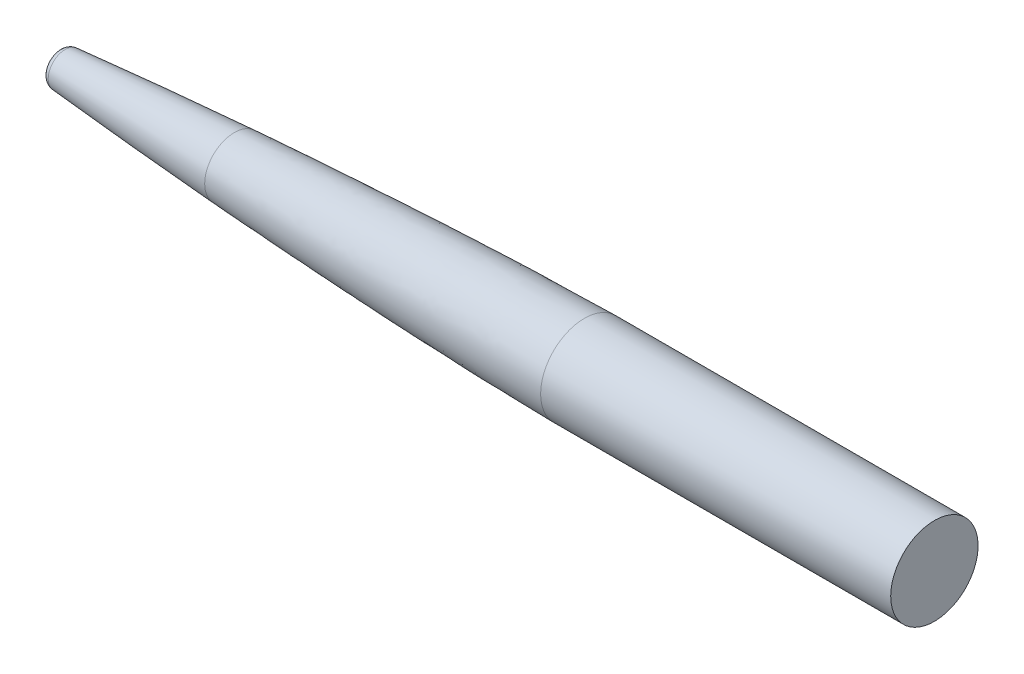
ISO-10303-21;
HEADER;
FILE_DESCRIPTION(('STEP AP214'),'2;1');
FILE_NAME('part.step','',(''),(''),'','','');
FILE_SCHEMA(('AUTOMOTIVE_DESIGN { 1 0 10303 214 1 1 1 1 }'));
ENDSEC;
DATA;
#1=APPLICATION_CONTEXT('core data for automotive mechanical design processes');
#2=APPLICATION_PROTOCOL_DEFINITION('international standard','automotive_design',2000,#1);
#3=PRODUCT_CONTEXT('',#1,'mechanical');
#4=PRODUCT('Part','Part','',(#3));
#5=PRODUCT_RELATED_PRODUCT_CATEGORY('part','',(#4));
#6=PRODUCT_DEFINITION_FORMATION('','',#4);
#7=PRODUCT_DEFINITION_CONTEXT('part definition',#1,'design');
#8=PRODUCT_DEFINITION('design','',#6,#7);
#9=PRODUCT_DEFINITION_SHAPE('','',#8);
#10=(LENGTH_UNIT() NAMED_UNIT(*) SI_UNIT(.MILLI.,.METRE.));
#11=(NAMED_UNIT(*) PLANE_ANGLE_UNIT() SI_UNIT($,.RADIAN.));
#12=(NAMED_UNIT(*) SI_UNIT($,.STERADIAN.) SOLID_ANGLE_UNIT());
#13=UNCERTAINTY_MEASURE_WITH_UNIT(LENGTH_MEASURE(1.E-05),#10,'distance_accuracy_value','');
#14=(GEOMETRIC_REPRESENTATION_CONTEXT(3) GLOBAL_UNCERTAINTY_ASSIGNED_CONTEXT((#13)) GLOBAL_UNIT_ASSIGNED_CONTEXT((#10,
#11,#12)) REPRESENTATION_CONTEXT('',''));
#15=CARTESIAN_POINT('',(0.,0.,0.));
#16=DIRECTION('',(0.,0.,1.));
#17=DIRECTION('',(1.,0.,0.));
#18=AXIS2_PLACEMENT_3D('',#15,#16,#17);
#19=CARTESIAN_POINT('',(177.8,0.,0.));
#20=DIRECTION('',(1.,0.,0.));
#21=DIRECTION('',(0.,0.,-1.));
#22=AXIS2_PLACEMENT_3D('',#19,#20,#21);
#23=PLANE('',#22);
#24=CARTESIAN_POINT('',(177.8,0.,0.));
#25=DIRECTION('',(1.,0.,0.));
#26=DIRECTION('',(0.,0.,-1.));
#27=AXIS2_PLACEMENT_3D('',#24,#25,#26);
#28=CIRCLE('',#27,7.6835);
#29=CARTESIAN_POINT('',(177.8,0.,-7.6835));
#30=VERTEX_POINT('',#29);
#31=EDGE_CURVE('E12',#30,#30,#28,.F.);
#32=ORIENTED_EDGE('',*,*,#31,.T.);
#33=EDGE_LOOP('',(#32));
#34=FACE_BOUND('',#33,.T.);
#35=CARTESIAN_POINT('',(177.8,0.,0.));
#36=DIRECTION('',(-1.,0.,0.));
#37=DIRECTION('',(0.,0.,1.));
#38=AXIS2_PLACEMENT_3D('',#35,#36,#37);
#39=CIRCLE('',#38,17.1561631561449);
#40=CARTESIAN_POINT('',(177.8,0.,17.1561631561449));
#41=VERTEX_POINT('',#40);
#42=EDGE_CURVE('E75',#41,#41,#39,.F.);
#43=ORIENTED_EDGE('',*,*,#42,.T.);
#44=EDGE_LOOP('',(#43));
#45=FACE_BOUND('',#44,.T.);
#46=ADVANCED_FACE('F53',(#34,#45),#23,.T.);
#47=CARTESIAN_POINT('',(381.,25.3619,0.));
#48=CARTESIAN_POINT('',(378.524593559037,25.3560980053445,0.));
#49=CARTESIAN_POINT('',(373.573934486035,25.3121128889867,0.));
#50=CARTESIAN_POINT('',(362.812607625121,25.1615270824821,0.));
#51=CARTESIAN_POINT('',(346.242443602137,24.8058332092385,0.));
#52=CARTESIAN_POINT('',(326.340171249397,24.2488561604149,0.));
#53=CARTESIAN_POINT('',(297.299602619171,23.2514406165286,0.));
#54=CARTESIAN_POINT('',(268.266826453605,22.0456358586878,0.));
#55=CARTESIAN_POINT('',(239.242169499469,20.6593607190887,0.));
#56=CARTESIAN_POINT('',(210.226471113295,19.0990664831563,0.));
#57=CARTESIAN_POINT('',(187.019770429096,17.7463170832523,0.));
#58=CARTESIAN_POINT('',(163.819588974037,16.285839146773,0.));
#59=CARTESIAN_POINT('',(140.626874096269,14.7110912909158,0.));
#60=CARTESIAN_POINT('',(117.442965680173,13.0111911873951,0.));
#61=CARTESIAN_POINT('',(94.2699405722977,11.1683965876158,0.));
#62=CARTESIAN_POINT('',(71.111079527847,9.1542171250851,0.));
#63=CARTESIAN_POINT('',(49.7481453938475,7.08897490579236,0.));
#64=CARTESIAN_POINT('',(31.8410851129706,5.12991227535654,0.));
#65=CARTESIAN_POINT('',(18.4911553593057,3.43769538635818,0.));
#66=CARTESIAN_POINT('',(10.2749378330354,2.22000164204755,0.));
#67=CARTESIAN_POINT('',(5.7055757200537,1.42868481896333,0.));
#68=CARTESIAN_POINT('',(3.28114901441044,0.942604320543406,0.));
#69=CARTESIAN_POINT('',(1.98341265106635,0.645281043026791,0.));
#70=CARTESIAN_POINT('',(1.26037027723223,0.458588114335736,0.));
#71=CARTESIAN_POINT('',(0.83282189617331,0.335886962993377,0.));
#72=CARTESIAN_POINT('',(0.570742032311502,0.252932932688025,0.));
#73=CARTESIAN_POINT('',(0.391244533489601,0.190542861533175,0.));
#74=CARTESIAN_POINT('',(0.271031854491536,0.144556968473102,0.));
#75=CARTESIAN_POINT('',(0.191250301377203,0.111419343372318,0.));
#76=CARTESIAN_POINT('',(0.124712658845111,0.0809738507329624,0.));
#77=CARTESIAN_POINT('',(0.077894833494557,0.0572325728760499,0.));
#78=CARTESIAN_POINT('',(0.0422729180777764,0.036450053215517,0.));
#79=CARTESIAN_POINT('',(0.0176817172437348,0.0192058780204196,0.));
#80=CARTESIAN_POINT('',(0.00638967288776374,0.00924561715961565,0.));
#81=CARTESIAN_POINT('',(0.00194370173082246,0.00324186171888322,0.));
#82=CARTESIAN_POINT('',(0.,0.,0.));
#83=B_SPLINE_CURVE_WITH_KNOTS('',4,(#47,#48,#49,#50,#51,#52,#53,#54,#55,#56,#57,#58,#59,#60,#61,
#62,#63,#64,#65,#66,#67,#68,#69,#70,#71,#72,#73,#74,#75,#76,#77,#78,#79,#80,#81,#82),
.UNSPECIFIED.,.F.,.F.,(5,1,1,1,1,1,1,1,1,1,1,1,1,1,1,1,1,1,1,1,1,1,1,1,1,1,1,1,1,1,1,1,5),(0.,
0.0259103187572514,0.0518206375145026,0.112650211825192,0.173479786222072,0.234309360683451,
0.355968509754322,0.416798084351541,0.47762765878568,0.538457233075586,0.599286807374725,
0.660116381670231,0.720945955951906,0.781775530233654,0.842605104692207,0.90343467923664,
0.945591870170838,0.970321497056124,0.983449830559251,0.990366810007663,0.994126820115043,
0.99620029420814,0.997383649493844,0.998182277212857,0.998782153188388,0.999077289957593,
0.999372426726798,0.999529320045099,0.999686213363399,0.9998431066817,0.99992155334085,
0.999960776670425,1.),.UNSPECIFIED.);
#84=CARTESIAN_POINT('',(0.,0.,0.));
#85=DIRECTION('',(-1.,0.,0.));
#86=AXIS1_PLACEMENT('',#84,#85);
#87=SURFACE_OF_REVOLUTION('',#83,#86);
#88=CARTESIAN_POINT('',(79.67419209287,0.,0.));
#89=DIRECTION('',(-1.,0.,0.));
#90=DIRECTION('',(0.,0.,1.));
#91=AXIS2_PLACEMENT_3D('',#88,#89,#90);
#92=CIRCLE('',#91,9.87959247335485);
#93=CARTESIAN_POINT('',(79.67419209287,0.,9.87959247335485));
#94=VERTEX_POINT('',#93);
#95=EDGE_CURVE('E64',#94,#94,#92,.F.);
#96=ORIENTED_EDGE('',*,*,#95,.T.);
#97=EDGE_LOOP('',(#96));
#98=FACE_BOUND('',#97,.T.);
#99=ORIENTED_EDGE('',*,*,#42,.F.);
#100=EDGE_LOOP('',(#99));
#101=FACE_BOUND('',#100,.T.);
#102=ADVANCED_FACE('F79',(#98,#101),#87,.T.);
#103=CARTESIAN_POINT('',(76.2,0.,0.));
#104=DIRECTION('',(1.,0.,0.));
#105=DIRECTION('',(0.,0.,-1.));
#106=AXIS2_PLACEMENT_3D('',#103,#104,#105);
#107=PLANE('',#106);
#108=CARTESIAN_POINT('',(76.2,0.,0.));
#109=DIRECTION('',(1.,0.,0.));
#110=DIRECTION('',(0.,0.,-1.));
#111=AXIS2_PLACEMENT_3D('',#108,#109,#110);
#112=CIRCLE('',#111,6.08442013872907);
#113=CARTESIAN_POINT('',(76.2,0.,-6.08442013872907));
#114=VERTEX_POINT('',#113);
#115=EDGE_CURVE('E68',#114,#114,#112,.F.);
#116=ORIENTED_EDGE('',*,*,#115,.T.);
#117=EDGE_LOOP('',(#116));
#118=FACE_BOUND('',#117,.T.);
#119=ADVANCED_FACE('F82',(#118),#107,.F.);
#120=CARTESIAN_POINT('',(80.01,0.,0.));
#121=DIRECTION('',(-1.,0.,0.));
#122=DIRECTION('',(0.,0.,1.));
#123=AXIS2_PLACEMENT_3D('',#120,#121,#122);
#124=TOROIDAL_SURFACE('',#123,6.08442013872907,3.81);
#125=ORIENTED_EDGE('',*,*,#115,.F.);
#126=EDGE_LOOP('',(#125));
#127=FACE_BOUND('',#126,.T.);
#128=ORIENTED_EDGE('',*,*,#95,.F.);
#129=EDGE_LOOP('',(#128));
#130=FACE_BOUND('',#129,.T.);
#131=ADVANCED_FACE('F87',(#127,#130),#124,.T.);
#132=CARTESIAN_POINT('',(163.83,0.,0.));
#133=DIRECTION('',(1.,0.,0.));
#134=DIRECTION('',(0.,0.,-1.));
#135=AXIS2_PLACEMENT_3D('',#132,#133,#134);
#136=CYLINDRICAL_SURFACE('',#135,6.4135);
#137=CARTESIAN_POINT('',(176.53,0.,0.));
#138=DIRECTION('',(1.,0.,0.));
#139=DIRECTION('',(0.,0.,-1.));
#140=AXIS2_PLACEMENT_3D('',#137,#138,#139);
#141=CIRCLE('',#140,6.4135);
#142=CARTESIAN_POINT('',(176.53,0.,-6.4135));
#143=VERTEX_POINT('',#142);
#144=EDGE_CURVE('E60',#143,#143,#141,.T.);
#145=ORIENTED_EDGE('',*,*,#144,.T.);
#146=EDGE_LOOP('',(#145));
#147=FACE_BOUND('',#146,.T.);
#148=CARTESIAN_POINT('',(163.83,0.,0.));
#149=DIRECTION('',(1.,0.,0.));
#150=DIRECTION('',(0.,0.,-1.));
#151=AXIS2_PLACEMENT_3D('',#148,#149,#150);
#152=CIRCLE('',#151,6.4135);
#153=CARTESIAN_POINT('',(163.83,0.,-6.4135));
#154=VERTEX_POINT('',#153);
#155=EDGE_CURVE('E105',#154,#154,#152,.T.);
#156=ORIENTED_EDGE('',*,*,#155,.F.);
#157=EDGE_LOOP('',(#156));
#158=FACE_BOUND('',#157,.T.);
#159=ADVANCED_FACE('F86',(#147,#158),#136,.F.);
#160=CARTESIAN_POINT('',(163.83,0.,0.));
#161=DIRECTION('',(1.,0.,0.));
#162=DIRECTION('',(0.,0.,-1.));
#163=AXIS2_PLACEMENT_3D('',#160,#161,#162);
#164=PLANE('',#163);
#165=ORIENTED_EDGE('',*,*,#155,.T.);
#166=EDGE_LOOP('',(#165));
#167=FACE_BOUND('',#166,.T.);
#168=ADVANCED_FACE('F96',(#167),#164,.T.);
#169=CARTESIAN_POINT('',(176.53,0.,0.));
#170=DIRECTION('',(1.,0.,0.));
#171=DIRECTION('',(0.,0.,-1.));
#172=AXIS2_PLACEMENT_3D('',#169,#170,#171);
#173=TOROIDAL_SURFACE('',#172,7.6835,1.27);
#174=ORIENTED_EDGE('',*,*,#31,.F.);
#175=EDGE_LOOP('',(#174));
#176=FACE_BOUND('',#175,.T.);
#177=ORIENTED_EDGE('',*,*,#144,.F.);
#178=EDGE_LOOP('',(#177));
#179=FACE_BOUND('',#178,.T.);
#180=ADVANCED_FACE('F55',(#176,#179),#173,.T.);
#181=CLOSED_SHELL('',(#46,#102,#119,#131,#159,#168,#180));
#182=MANIFOLD_SOLID_BREP('B2_NOT_SHOWN',#181);
#183=CARTESIAN_POINT('',(381.,0.,0.));
#184=DIRECTION('',(1.,0.,0.));
#185=DIRECTION('',(0.,0.,-1.));
#186=AXIS2_PLACEMENT_3D('',#183,#184,#185);
#187=PLANE('',#186);
#188=CARTESIAN_POINT('',(381.,0.,0.));
#189=DIRECTION('',(-1.,0.,0.));
#190=DIRECTION('',(0.,0.,1.));
#191=AXIS2_PLACEMENT_3D('',#188,#189,#190);
#192=CIRCLE('',#191,6.35);
#193=CARTESIAN_POINT('',(381.,0.,6.35));
#194=VERTEX_POINT('',#193);
#195=EDGE_CURVE('E52',#194,#194,#192,.T.);
#196=ORIENTED_EDGE('',*,*,#195,.F.);
#197=EDGE_LOOP('',(#196));
#198=FACE_BOUND('',#197,.T.);
#199=CARTESIAN_POINT('',(381.,0.,0.));
#200=DIRECTION('',(-1.,0.,0.));
#201=DIRECTION('',(0.,0.,1.));
#202=AXIS2_PLACEMENT_3D('',#199,#200,#201);
#203=CIRCLE('',#202,25.3619);
#204=CARTESIAN_POINT('',(381.,0.,25.3619));
#205=VERTEX_POINT('',#204);
#206=EDGE_CURVE('E167',#205,#205,#203,.T.);
#207=ORIENTED_EDGE('',*,*,#206,.T.);
#208=EDGE_LOOP('',(#207));
#209=FACE_BOUND('',#208,.T.);
#210=ADVANCED_FACE('F164',(#198,#209),#187,.F.);
#211=CARTESIAN_POINT('',(584.2,0.,0.));
#212=DIRECTION('',(-1.,0.,0.));
#213=DIRECTION('',(0.,0.,1.));
#214=AXIS2_PLACEMENT_3D('',#211,#212,#213);
#215=PLANE('',#214);
#216=CARTESIAN_POINT('',(584.2,0.,0.));
#217=DIRECTION('',(-1.,0.,0.));
#218=DIRECTION('',(0.,0.,1.));
#219=AXIS2_PLACEMENT_3D('',#216,#217,#218);
#220=CIRCLE('',#219,25.3619000000002);
#221=CARTESIAN_POINT('',(584.2,0.,25.3619000000002));
#222=VERTEX_POINT('',#221);
#223=EDGE_CURVE('E171',#222,#222,#220,.T.);
#224=ORIENTED_EDGE('',*,*,#223,.F.);
#225=EDGE_LOOP('',(#224));
#226=FACE_BOUND('',#225,.T.);
#227=ADVANCED_FACE('F189',(#226),#215,.F.);
#228=CARTESIAN_POINT('',(0.,0.,0.));
#229=DIRECTION('',(-1.,0.,0.));
#230=DIRECTION('',(0.,0.,1.));
#231=AXIS2_PLACEMENT_3D('',#228,#229,#230);
#232=CYLINDRICAL_SURFACE('',#231,25.3619000000001);
#233=ORIENTED_EDGE('',*,*,#206,.F.);
#234=EDGE_LOOP('',(#233));
#235=FACE_BOUND('',#234,.T.);
#236=ORIENTED_EDGE('',*,*,#223,.T.);
#237=EDGE_LOOP('',(#236));
#238=FACE_BOUND('',#237,.T.);
#239=ADVANCED_FACE('F185',(#235,#238),#232,.T.);
#240=CARTESIAN_POINT('',(368.3,0.,0.));
#241=DIRECTION('',(1.,0.,0.));
#242=DIRECTION('',(0.,0.,-1.));
#243=AXIS2_PLACEMENT_3D('',#240,#241,#242);
#244=CYLINDRICAL_SURFACE('',#243,6.35);
#245=CARTESIAN_POINT('',(368.3,0.,0.));
#246=DIRECTION('',(-1.,0.,0.));
#247=DIRECTION('',(0.,0.,1.));
#248=AXIS2_PLACEMENT_3D('',#245,#246,#247);
#249=CIRCLE('',#248,6.35);
#250=CARTESIAN_POINT('',(368.3,0.,6.35));
#251=VERTEX_POINT('',#250);
#252=EDGE_CURVE('E177',#251,#251,#249,.T.);
#253=ORIENTED_EDGE('',*,*,#252,.F.);
#254=EDGE_LOOP('',(#253));
#255=FACE_BOUND('',#254,.T.);
#256=ORIENTED_EDGE('',*,*,#195,.T.);
#257=EDGE_LOOP('',(#256));
#258=FACE_BOUND('',#257,.T.);
#259=ADVANCED_FACE('F188',(#255,#258),#244,.T.);
#260=CARTESIAN_POINT('',(368.3,0.,0.));
#261=DIRECTION('',(-1.,0.,0.));
#262=DIRECTION('',(0.,0.,1.));
#263=AXIS2_PLACEMENT_3D('',#260,#261,#262);
#264=PLANE('',#263);
#265=ORIENTED_EDGE('',*,*,#252,.T.);
#266=EDGE_LOOP('',(#265));
#267=FACE_BOUND('',#266,.T.);
#268=ADVANCED_FACE('F200',(#267),#264,.T.);
#269=CLOSED_SHELL('',(#210,#227,#239,#259,#268));
#270=MANIFOLD_SOLID_BREP('B7',#269);
#271=CARTESIAN_POINT('',(177.8,0.,0.));
#272=DIRECTION('',(1.,0.,0.));
#273=DIRECTION('',(0.,0.,-1.));
#274=AXIS2_PLACEMENT_3D('',#271,#272,#273);
#275=PLANE('',#274);
#276=CARTESIAN_POINT('',(177.8,0.,0.));
#277=DIRECTION('',(-1.,0.,0.));
#278=DIRECTION('',(0.,0.,1.));
#279=AXIS2_PLACEMENT_3D('',#276,#277,#278);
#280=CIRCLE('',#279,6.35);
#281=CARTESIAN_POINT('',(177.8,0.,6.35));
#282=VERTEX_POINT('',#281);
#283=EDGE_CURVE('E163',#282,#282,#280,.T.);
#284=ORIENTED_EDGE('',*,*,#283,.F.);
#285=EDGE_LOOP('',(#284));
#286=FACE_BOUND('',#285,.T.);
#287=CARTESIAN_POINT('',(177.8,0.,0.));
#288=DIRECTION('',(-1.,0.,0.));
#289=DIRECTION('',(0.,0.,1.));
#290=AXIS2_PLACEMENT_3D('',#287,#288,#289);
#291=CIRCLE('',#290,17.1561631561449);
#292=CARTESIAN_POINT('',(177.8,0.,17.1561631561449));
#293=VERTEX_POINT('',#292);
#294=EDGE_CURVE('E283',#293,#293,#291,.F.);
#295=ORIENTED_EDGE('',*,*,#294,.F.);
#296=EDGE_LOOP('',(#295));
#297=FACE_BOUND('',#296,.T.);
#298=ADVANCED_FACE('F233',(#286,#297),#275,.F.);
#299=CARTESIAN_POINT('',(381.,0.,0.));
#300=DIRECTION('',(1.,0.,0.));
#301=DIRECTION('',(0.,0.,-1.));
#302=AXIS2_PLACEMENT_3D('',#299,#300,#301);
#303=PLANE('',#302);
#304=CARTESIAN_POINT('',(381.,0.,0.));
#305=DIRECTION('',(1.,0.,0.));
#306=DIRECTION('',(0.,0.,-1.));
#307=AXIS2_PLACEMENT_3D('',#304,#305,#306);
#308=CIRCLE('',#307,7.6835);
#309=CARTESIAN_POINT('',(381.,0.,-7.6835));
#310=VERTEX_POINT('',#309);
#311=EDGE_CURVE('E237',#310,#310,#308,.F.);
#312=ORIENTED_EDGE('',*,*,#311,.T.);
#313=EDGE_LOOP('',(#312));
#314=FACE_BOUND('',#313,.T.);
#315=CARTESIAN_POINT('',(381.,0.,0.));
#316=DIRECTION('',(-1.,0.,0.));
#317=DIRECTION('',(0.,0.,1.));
#318=AXIS2_PLACEMENT_3D('',#315,#316,#317);
#319=CIRCLE('',#318,25.3619);
#320=CARTESIAN_POINT('',(381.,0.,25.3619));
#321=VERTEX_POINT('',#320);
#322=EDGE_CURVE('E252',#321,#321,#319,.T.);
#323=ORIENTED_EDGE('',*,*,#322,.F.);
#324=EDGE_LOOP('',(#323));
#325=FACE_BOUND('',#324,.T.);
#326=ADVANCED_FACE('F267',(#314,#325),#303,.T.);
#327=CARTESIAN_POINT('',(381.,25.3619,0.));
#328=CARTESIAN_POINT('',(378.524593559037,25.3560980053445,0.));
#329=CARTESIAN_POINT('',(373.573934486035,25.3121128889867,0.));
#330=CARTESIAN_POINT('',(362.812607625121,25.1615270824821,0.));
#331=CARTESIAN_POINT('',(346.242443602137,24.8058332092385,0.));
#332=CARTESIAN_POINT('',(326.340171249397,24.2488561604149,0.));
#333=CARTESIAN_POINT('',(297.299602619171,23.2514406165286,0.));
#334=CARTESIAN_POINT('',(268.266826453605,22.0456358586878,0.));
#335=CARTESIAN_POINT('',(239.242169499469,20.6593607190887,0.));
#336=CARTESIAN_POINT('',(210.226471113295,19.0990664831563,0.));
#337=CARTESIAN_POINT('',(187.019770429096,17.7463170832523,0.));
#338=CARTESIAN_POINT('',(163.819588974037,16.285839146773,0.));
#339=CARTESIAN_POINT('',(140.626874096269,14.7110912909158,0.));
#340=CARTESIAN_POINT('',(117.442965680173,13.0111911873951,0.));
#341=CARTESIAN_POINT('',(94.2699405722977,11.1683965876158,0.));
#342=CARTESIAN_POINT('',(71.111079527847,9.1542171250851,0.));
#343=CARTESIAN_POINT('',(49.7481453938475,7.08897490579236,0.));
#344=CARTESIAN_POINT('',(31.8410851129706,5.12991227535654,0.));
#345=CARTESIAN_POINT('',(18.4911553593057,3.43769538635818,0.));
#346=CARTESIAN_POINT('',(10.2749378330354,2.22000164204755,0.));
#347=CARTESIAN_POINT('',(5.7055757200537,1.42868481896333,0.));
#348=CARTESIAN_POINT('',(3.28114901441044,0.942604320543406,0.));
#349=CARTESIAN_POINT('',(1.98341265106635,0.645281043026791,0.));
#350=CARTESIAN_POINT('',(1.26037027723223,0.458588114335736,0.));
#351=CARTESIAN_POINT('',(0.83282189617331,0.335886962993377,0.));
#352=CARTESIAN_POINT('',(0.570742032311502,0.252932932688025,0.));
#353=CARTESIAN_POINT('',(0.391244533489601,0.190542861533175,0.));
#354=CARTESIAN_POINT('',(0.271031854491536,0.144556968473102,0.));
#355=CARTESIAN_POINT('',(0.191250301377203,0.111419343372318,0.));
#356=CARTESIAN_POINT('',(0.124712658845111,0.0809738507329624,0.));
#357=CARTESIAN_POINT('',(0.077894833494557,0.0572325728760499,0.));
#358=CARTESIAN_POINT('',(0.0422729180777764,0.036450053215517,0.));
#359=CARTESIAN_POINT('',(0.0176817172437348,0.0192058780204196,0.));
#360=CARTESIAN_POINT('',(0.00638967288776374,0.00924561715961565,0.));
#361=CARTESIAN_POINT('',(0.00194370173082246,0.00324186171888322,0.));
#362=CARTESIAN_POINT('',(0.,0.,0.));
#363=B_SPLINE_CURVE_WITH_KNOTS('',4,(#327,#328,#329,#330,#331,#332,#333,#334,#335,#336,#337,
#338,#339,#340,#341,#342,#343,#344,#345,#346,#347,#348,#349,#350,#351,#352,#353,#354,#355,#356,
#357,#358,#359,#360,#361,#362),.UNSPECIFIED.,.F.,.F.,(5,1,1,1,1,1,1,1,1,1,1,1,1,1,1,1,1,1,1,1,1,
1,1,1,1,1,1,1,1,1,1,1,5),(0.,0.0259103187572514,0.0518206375145026,0.112650211825192,
0.173479786222072,0.234309360683451,0.355968509754322,0.416798084351541,0.47762765878568,
0.538457233075586,0.599286807374725,0.660116381670231,0.720945955951906,0.781775530233654,
0.842605104692207,0.90343467923664,0.945591870170838,0.970321497056124,0.983449830559251,
0.990366810007663,0.994126820115043,0.99620029420814,0.997383649493844,0.998182277212857,
0.998782153188388,0.999077289957593,0.999372426726798,0.999529320045099,0.999686213363399,
0.9998431066817,0.99992155334085,0.999960776670425,1.),.UNSPECIFIED.);
#364=CARTESIAN_POINT('',(0.,0.,0.));
#365=DIRECTION('',(-1.,0.,0.));
#366=AXIS1_PLACEMENT('',#364,#365);
#367=SURFACE_OF_REVOLUTION('',#363,#366);
#368=ORIENTED_EDGE('',*,*,#294,.T.);
#369=EDGE_LOOP('',(#368));
#370=FACE_BOUND('',#369,.T.);
#371=ORIENTED_EDGE('',*,*,#322,.T.);
#372=EDGE_LOOP('',(#371));
#373=FACE_BOUND('',#372,.T.);
#374=ADVANCED_FACE('F262',(#370,#373),#367,.T.);
#375=CARTESIAN_POINT('',(367.03,0.,0.));
#376=DIRECTION('',(1.,0.,0.));
#377=DIRECTION('',(0.,0.,-1.));
#378=AXIS2_PLACEMENT_3D('',#375,#376,#377);
#379=CYLINDRICAL_SURFACE('',#378,6.4135);
#380=CARTESIAN_POINT('',(379.73,0.,0.));
#381=DIRECTION('',(1.,0.,0.));
#382=DIRECTION('',(0.,0.,-1.));
#383=AXIS2_PLACEMENT_3D('',#380,#381,#382);
#384=CIRCLE('',#383,6.4135);
#385=CARTESIAN_POINT('',(379.73,0.,-6.4135));
#386=VERTEX_POINT('',#385);
#387=EDGE_CURVE('E245',#386,#386,#384,.T.);
#388=ORIENTED_EDGE('',*,*,#387,.T.);
#389=EDGE_LOOP('',(#388));
#390=FACE_BOUND('',#389,.T.);
#391=CARTESIAN_POINT('',(367.03,0.,0.));
#392=DIRECTION('',(1.,0.,0.));
#393=DIRECTION('',(0.,0.,-1.));
#394=AXIS2_PLACEMENT_3D('',#391,#392,#393);
#395=CIRCLE('',#394,6.4135);
#396=CARTESIAN_POINT('',(367.03,0.,-6.4135));
#397=VERTEX_POINT('',#396);
#398=EDGE_CURVE('E249',#397,#397,#395,.T.);
#399=ORIENTED_EDGE('',*,*,#398,.F.);
#400=EDGE_LOOP('',(#399));
#401=FACE_BOUND('',#400,.T.);
#402=ADVANCED_FACE('F266',(#390,#401),#379,.F.);
#403=CARTESIAN_POINT('',(367.03,0.,0.));
#404=DIRECTION('',(1.,0.,0.));
#405=DIRECTION('',(0.,0.,-1.));
#406=AXIS2_PLACEMENT_3D('',#403,#404,#405);
#407=PLANE('',#406);
#408=ORIENTED_EDGE('',*,*,#398,.T.);
#409=EDGE_LOOP('',(#408));
#410=FACE_BOUND('',#409,.T.);
#411=ADVANCED_FACE('F293',(#410),#407,.T.);
#412=CARTESIAN_POINT('',(379.73,0.,0.));
#413=DIRECTION('',(1.,0.,0.));
#414=DIRECTION('',(0.,0.,-1.));
#415=AXIS2_PLACEMENT_3D('',#412,#413,#414);
#416=TOROIDAL_SURFACE('',#415,7.6835,1.27);
#417=ORIENTED_EDGE('',*,*,#311,.F.);
#418=EDGE_LOOP('',(#417));
#419=FACE_BOUND('',#418,.T.);
#420=ORIENTED_EDGE('',*,*,#387,.F.);
#421=EDGE_LOOP('',(#420));
#422=FACE_BOUND('',#421,.T.);
#423=ADVANCED_FACE('F235',(#419,#422),#416,.T.);
#424=CARTESIAN_POINT('',(165.1,0.,0.));
#425=DIRECTION('',(1.,0.,0.));
#426=DIRECTION('',(0.,0.,-1.));
#427=AXIS2_PLACEMENT_3D('',#424,#425,#426);
#428=CYLINDRICAL_SURFACE('',#427,6.35);
#429=CARTESIAN_POINT('',(165.1,0.,0.));
#430=DIRECTION('',(-1.,0.,0.));
#431=DIRECTION('',(0.,0.,1.));
#432=AXIS2_PLACEMENT_3D('',#429,#430,#431);
#433=CIRCLE('',#432,6.35);
#434=CARTESIAN_POINT('',(165.1,0.,6.35));
#435=VERTEX_POINT('',#434);
#436=EDGE_CURVE('E248',#435,#435,#433,.T.);
#437=ORIENTED_EDGE('',*,*,#436,.F.);
#438=EDGE_LOOP('',(#437));
#439=FACE_BOUND('',#438,.T.);
#440=ORIENTED_EDGE('',*,*,#283,.T.);
#441=EDGE_LOOP('',(#440));
#442=FACE_BOUND('',#441,.T.);
#443=ADVANCED_FACE('F292',(#439,#442),#428,.T.);
#444=CARTESIAN_POINT('',(165.1,0.,0.));
#445=DIRECTION('',(-1.,0.,0.));
#446=DIRECTION('',(0.,0.,1.));
#447=AXIS2_PLACEMENT_3D('',#444,#445,#446);
#448=PLANE('',#447);
#449=ORIENTED_EDGE('',*,*,#436,.T.);
#450=EDGE_LOOP('',(#449));
#451=FACE_BOUND('',#450,.T.);
#452=ADVANCED_FACE('F298',(#451),#448,.T.);
#453=CLOSED_SHELL('',(#298,#326,#374,#402,#411,#423,#443,#452));
#454=MANIFOLD_SOLID_BREP('B47_NOT_SHOWN',#453);
#455=ADVANCED_BREP_SHAPE_REPRESENTATION('',(#18,#182,#270,#454),#14);
#456=SHAPE_DEFINITION_REPRESENTATION(#9,#455);
ENDSEC;
END-ISO-10303-21;
